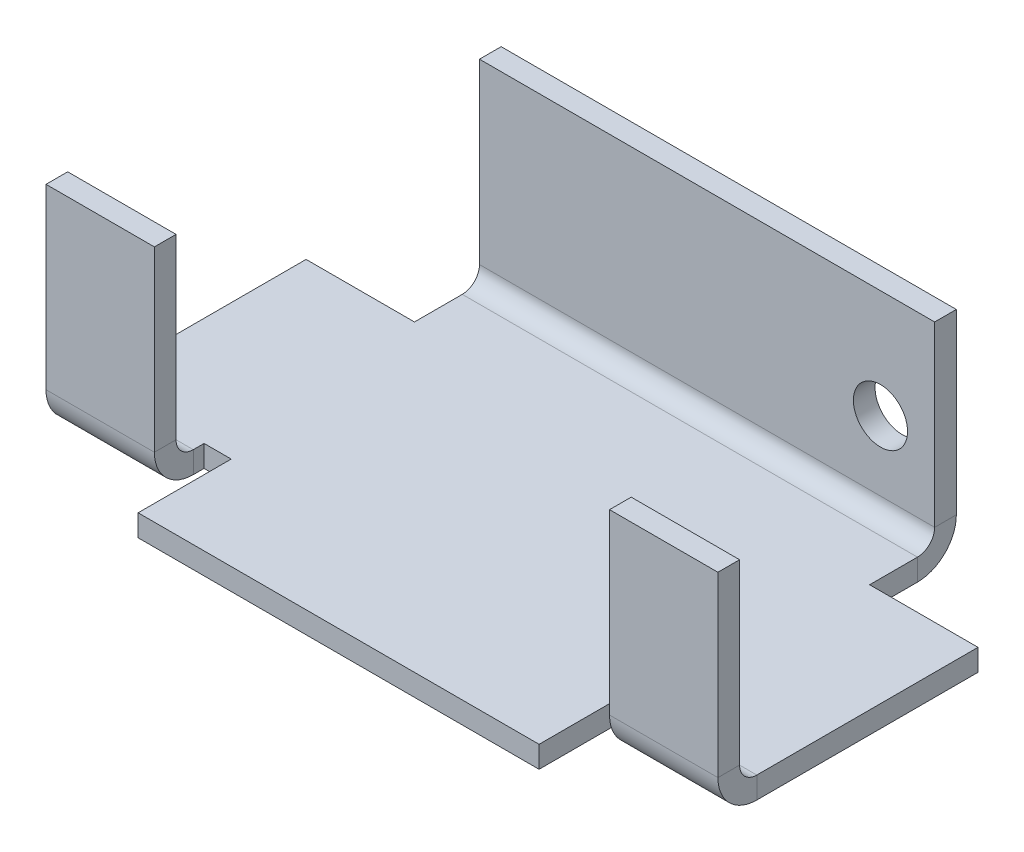
ISO-10303-21;
HEADER;
FILE_DESCRIPTION(('STEP AP214'),'2;1');
FILE_NAME('part.step','',(''),(''),'','','');
FILE_SCHEMA(('AUTOMOTIVE_DESIGN { 1 0 10303 214 1 1 1 1 }'));
ENDSEC;
DATA;
#1=APPLICATION_CONTEXT('core data for automotive mechanical design processes');
#2=APPLICATION_PROTOCOL_DEFINITION('international standard','automotive_design',2000,#1);
#3=PRODUCT_CONTEXT('',#1,'mechanical');
#4=PRODUCT('Part','Part','',(#3));
#5=PRODUCT_RELATED_PRODUCT_CATEGORY('part','',(#4));
#6=PRODUCT_DEFINITION_FORMATION('','',#4);
#7=PRODUCT_DEFINITION_CONTEXT('part definition',#1,'design');
#8=PRODUCT_DEFINITION('design','',#6,#7);
#9=PRODUCT_DEFINITION_SHAPE('','',#8);
#10=(LENGTH_UNIT() NAMED_UNIT(*) SI_UNIT(.MILLI.,.METRE.));
#11=(NAMED_UNIT(*) PLANE_ANGLE_UNIT() SI_UNIT($,.RADIAN.));
#12=(NAMED_UNIT(*) SI_UNIT($,.STERADIAN.) SOLID_ANGLE_UNIT());
#13=UNCERTAINTY_MEASURE_WITH_UNIT(LENGTH_MEASURE(1.E-05),#10,'distance_accuracy_value','');
#14=(GEOMETRIC_REPRESENTATION_CONTEXT(3) GLOBAL_UNCERTAINTY_ASSIGNED_CONTEXT((#13)) GLOBAL_UNIT_ASSIGNED_CONTEXT((#10,
#11,#12)) REPRESENTATION_CONTEXT('',''));
#15=CARTESIAN_POINT('',(0.,0.,0.));
#16=DIRECTION('',(0.,0.,1.));
#17=DIRECTION('',(1.,0.,0.));
#18=AXIS2_PLACEMENT_3D('',#15,#16,#17);
#19=CARTESIAN_POINT('',(0.,-2.,0.));
#20=DIRECTION('',(0.,-1.,0.));
#21=DIRECTION('',(0.,0.,-1.));
#22=AXIS2_PLACEMENT_3D('',#19,#20,#21);
#23=PLANE('',#22);
#24=DIRECTION('',(0.,0.,1.));
#25=VECTOR('',#24,1.);
#26=CARTESIAN_POINT('',(39.5,-2.,-8.5875));
#27=LINE('',#26,#25);
#28=CARTESIAN_POINT('',(39.5,-2.,-8.5875));
#29=VERTEX_POINT('',#28);
#30=CARTESIAN_POINT('',(39.5,-2.,0.));
#31=VERTEX_POINT('',#30);
#32=EDGE_CURVE('E291',#29,#31,#27,.T.);
#33=ORIENTED_EDGE('',*,*,#32,.T.);
#34=DIRECTION('',(1.,0.,0.));
#35=VECTOR('',#34,1.);
#36=CARTESIAN_POINT('',(0.,-2.,0.));
#37=LINE('',#36,#35);
#38=CARTESIAN_POINT('',(2.5,-2.,0.));
#39=VERTEX_POINT('',#38);
#40=EDGE_CURVE('E108',#39,#31,#37,.T.);
#41=ORIENTED_EDGE('',*,*,#40,.F.);
#42=DIRECTION('',(0.,0.,-1.));
#43=VECTOR('',#42,1.);
#44=CARTESIAN_POINT('',(2.5,-2.,-8.5875));
#45=LINE('',#44,#43);
#46=CARTESIAN_POINT('',(2.5,-2.,-8.5875));
#47=VERTEX_POINT('',#46);
#48=EDGE_CURVE('E321',#39,#47,#45,.T.);
#49=ORIENTED_EDGE('',*,*,#48,.T.);
#50=DIRECTION('',(-1.,0.,0.));
#51=VECTOR('',#50,1.);
#52=CARTESIAN_POINT('',(0.,-2.,-8.5875));
#53=LINE('',#52,#51);
#54=CARTESIAN_POINT('',(0.,-2.,-8.5875));
#55=VERTEX_POINT('',#54);
#56=EDGE_CURVE('E116',#47,#55,#53,.T.);
#57=ORIENTED_EDGE('',*,*,#56,.T.);
#58=DIRECTION('',(0.,0.,1.));
#59=VECTOR('',#58,1.);
#60=CARTESIAN_POINT('',(0.,-2.,0.));
#61=LINE('',#60,#59);
#62=CARTESIAN_POINT('',(0.,-2.00000000000001,-7.5875));
#63=VERTEX_POINT('',#62);
#64=EDGE_CURVE('E445',#55,#63,#61,.T.);
#65=ORIENTED_EDGE('',*,*,#64,.T.);
#66=DIRECTION('',(1.,0.,0.));
#67=VECTOR('',#66,1.);
#68=CARTESIAN_POINT('',(0.,-2.00000000000001,-7.5875));
#69=LINE('',#68,#67);
#70=CARTESIAN_POINT('',(-10.,-2.,-7.5875));
#71=VERTEX_POINT('',#70);
#72=EDGE_CURVE('E419',#63,#71,#69,.F.);
#73=ORIENTED_EDGE('',*,*,#72,.T.);
#74=DIRECTION('',(0.,0.,1.));
#75=VECTOR('',#74,1.);
#76=CARTESIAN_POINT('',(-10.,-2.,-28.));
#77=LINE('',#76,#75);
#78=CARTESIAN_POINT('',(-10.,-2.,-28.));
#79=VERTEX_POINT('',#78);
#80=EDGE_CURVE('E508',#79,#71,#77,.T.);
#81=ORIENTED_EDGE('',*,*,#80,.F.);
#82=DIRECTION('',(-1.,0.,0.));
#83=VECTOR('',#82,1.);
#84=CARTESIAN_POINT('',(0.,-2.,-28.));
#85=LINE('',#84,#83);
#86=CARTESIAN_POINT('',(0.,-2.,-28.));
#87=VERTEX_POINT('',#86);
#88=EDGE_CURVE('E505',#87,#79,#85,.T.);
#89=ORIENTED_EDGE('',*,*,#88,.F.);
#90=DIRECTION('',(0.,0.,1.));
#91=VECTOR('',#90,1.);
#92=CARTESIAN_POINT('',(0.,-2.,0.));
#93=LINE('',#92,#91);
#94=CARTESIAN_POINT('',(0.,-2.00000000000002,-32.4125));
#95=VERTEX_POINT('',#94);
#96=EDGE_CURVE('E536',#95,#87,#93,.T.);
#97=ORIENTED_EDGE('',*,*,#96,.F.);
#98=DIRECTION('',(-1.,0.,0.));
#99=VECTOR('',#98,1.);
#100=CARTESIAN_POINT('',(0.,-2.00000000000002,-32.4125));
#101=LINE('',#100,#99);
#102=CARTESIAN_POINT('',(42.,-2.,-32.4125));
#103=VERTEX_POINT('',#102);
#104=EDGE_CURVE('E482',#95,#103,#101,.F.);
#105=ORIENTED_EDGE('',*,*,#104,.T.);
#106=DIRECTION('',(0.,0.,-1.));
#107=VECTOR('',#106,1.);
#108=CARTESIAN_POINT('',(42.,-2.,0.));
#109=LINE('',#108,#107);
#110=CARTESIAN_POINT('',(42.,-2.,-28.));
#111=VERTEX_POINT('',#110);
#112=EDGE_CURVE('E13',#111,#103,#109,.T.);
#113=ORIENTED_EDGE('',*,*,#112,.F.);
#114=DIRECTION('',(-1.,0.,0.));
#115=VECTOR('',#114,1.);
#116=CARTESIAN_POINT('',(42.,-2.,-28.));
#117=LINE('',#116,#115);
#118=CARTESIAN_POINT('',(52.,-2.,-28.));
#119=VERTEX_POINT('',#118);
#120=EDGE_CURVE('E524',#119,#111,#117,.T.);
#121=ORIENTED_EDGE('',*,*,#120,.F.);
#122=DIRECTION('',(0.,0.,-1.));
#123=VECTOR('',#122,1.);
#124=CARTESIAN_POINT('',(52.,-2.,-28.));
#125=LINE('',#124,#123);
#126=CARTESIAN_POINT('',(52.,-2.00000000000001,-7.5875));
#127=VERTEX_POINT('',#126);
#128=EDGE_CURVE('E522',#127,#119,#125,.T.);
#129=ORIENTED_EDGE('',*,*,#128,.F.);
#130=DIRECTION('',(1.,0.,0.));
#131=VECTOR('',#130,1.);
#132=CARTESIAN_POINT('',(52.,-2.00000000000001,-7.5875));
#133=LINE('',#132,#131);
#134=CARTESIAN_POINT('',(42.,-2.,-7.5875));
#135=VERTEX_POINT('',#134);
#136=EDGE_CURVE('E361',#127,#135,#133,.F.);
#137=ORIENTED_EDGE('',*,*,#136,.T.);
#138=DIRECTION('',(0.,0.,-1.));
#139=VECTOR('',#138,1.);
#140=CARTESIAN_POINT('',(42.,-2.,0.));
#141=LINE('',#140,#139);
#142=CARTESIAN_POINT('',(42.,-2.,-8.5875));
#143=VERTEX_POINT('',#142);
#144=EDGE_CURVE('E295',#135,#143,#141,.T.);
#145=ORIENTED_EDGE('',*,*,#144,.T.);
#146=DIRECTION('',(-1.,0.,0.));
#147=VECTOR('',#146,1.);
#148=CARTESIAN_POINT('',(0.,-2.,-8.5875));
#149=LINE('',#148,#147);
#150=EDGE_CURVE('E287',#143,#29,#149,.T.);
#151=ORIENTED_EDGE('',*,*,#150,.T.);
#152=EDGE_LOOP('',(#33,#41,#49,#57,#65,#73,#81,#89,#97,#105,#113,#121,#129,#137,#145,#151));
#153=FACE_BOUND('',#152,.T.);
#154=ADVANCED_FACE('F99',(#153),#23,.T.);
#155=CARTESIAN_POINT('',(0.,0.,0.));
#156=DIRECTION('',(0.,-1.,0.));
#157=DIRECTION('',(0.,0.,-1.));
#158=AXIS2_PLACEMENT_3D('',#155,#156,#157);
#159=PLANE('',#158);
#160=DIRECTION('',(1.,0.,0.));
#161=VECTOR('',#160,1.);
#162=CARTESIAN_POINT('',(0.,0.,0.));
#163=LINE('',#162,#161);
#164=CARTESIAN_POINT('',(2.5,0.,0.));
#165=VERTEX_POINT('',#164);
#166=CARTESIAN_POINT('',(39.5,0.,0.));
#167=VERTEX_POINT('',#166);
#168=EDGE_CURVE('E539',#165,#167,#163,.T.);
#169=ORIENTED_EDGE('',*,*,#168,.T.);
#170=DIRECTION('',(0.,0.,1.));
#171=VECTOR('',#170,1.);
#172=CARTESIAN_POINT('',(39.5,0.,-8.5875));
#173=LINE('',#172,#171);
#174=CARTESIAN_POINT('',(39.5,0.,-8.5875));
#175=VERTEX_POINT('',#174);
#176=EDGE_CURVE('E311',#175,#167,#173,.T.);
#177=ORIENTED_EDGE('',*,*,#176,.F.);
#178=DIRECTION('',(-1.,0.,0.));
#179=VECTOR('',#178,1.);
#180=CARTESIAN_POINT('',(42.,0.,-8.5875));
#181=LINE('',#180,#179);
#182=CARTESIAN_POINT('',(42.,0.,-8.5875));
#183=VERTEX_POINT('',#182);
#184=EDGE_CURVE('E304',#183,#175,#181,.T.);
#185=ORIENTED_EDGE('',*,*,#184,.F.);
#186=DIRECTION('',(0.,0.,-1.));
#187=VECTOR('',#186,1.);
#188=CARTESIAN_POINT('',(42.,0.,-7.5875));
#189=LINE('',#188,#187);
#190=CARTESIAN_POINT('',(42.,0.,-7.5875));
#191=VERTEX_POINT('',#190);
#192=EDGE_CURVE('E298',#191,#183,#189,.T.);
#193=ORIENTED_EDGE('',*,*,#192,.F.);
#194=DIRECTION('',(1.,0.,0.));
#195=VECTOR('',#194,1.);
#196=CARTESIAN_POINT('',(52.,0.,-7.5875));
#197=LINE('',#196,#195);
#198=CARTESIAN_POINT('',(52.,0.,-7.5875));
#199=VERTEX_POINT('',#198);
#200=EDGE_CURVE('E373',#199,#191,#197,.F.);
#201=ORIENTED_EDGE('',*,*,#200,.F.);
#202=DIRECTION('',(0.,0.,-1.));
#203=VECTOR('',#202,1.);
#204=CARTESIAN_POINT('',(52.,0.,-28.));
#205=LINE('',#204,#203);
#206=CARTESIAN_POINT('',(52.,0.,-28.));
#207=VERTEX_POINT('',#206);
#208=EDGE_CURVE('E519',#199,#207,#205,.T.);
#209=ORIENTED_EDGE('',*,*,#208,.T.);
#210=DIRECTION('',(-1.,0.,0.));
#211=VECTOR('',#210,1.);
#212=CARTESIAN_POINT('',(42.,0.,-28.));
#213=LINE('',#212,#211);
#214=CARTESIAN_POINT('',(42.,0.,-28.));
#215=VERTEX_POINT('',#214);
#216=EDGE_CURVE('E525',#207,#215,#213,.T.);
#217=ORIENTED_EDGE('',*,*,#216,.T.);
#218=DIRECTION('',(0.,0.,-1.));
#219=VECTOR('',#218,1.);
#220=CARTESIAN_POINT('',(42.,0.,0.));
#221=LINE('',#220,#219);
#222=CARTESIAN_POINT('',(42.,0.,-32.4125));
#223=VERTEX_POINT('',#222);
#224=EDGE_CURVE('E103',#215,#223,#221,.T.);
#225=ORIENTED_EDGE('',*,*,#224,.T.);
#226=DIRECTION('',(-1.,0.,0.));
#227=VECTOR('',#226,1.);
#228=CARTESIAN_POINT('',(0.,0.,-32.4125));
#229=LINE('',#228,#227);
#230=CARTESIAN_POINT('',(0.,0.,-32.4125));
#231=VERTEX_POINT('',#230);
#232=EDGE_CURVE('E495',#231,#223,#229,.F.);
#233=ORIENTED_EDGE('',*,*,#232,.F.);
#234=DIRECTION('',(0.,0.,1.));
#235=VECTOR('',#234,1.);
#236=CARTESIAN_POINT('',(0.,0.,0.));
#237=LINE('',#236,#235);
#238=CARTESIAN_POINT('',(0.,0.,-28.));
#239=VERTEX_POINT('',#238);
#240=EDGE_CURVE('E533',#231,#239,#237,.T.);
#241=ORIENTED_EDGE('',*,*,#240,.T.);
#242=DIRECTION('',(-1.,0.,0.));
#243=VECTOR('',#242,1.);
#244=CARTESIAN_POINT('',(0.,0.,-28.));
#245=LINE('',#244,#243);
#246=CARTESIAN_POINT('',(-10.,0.,-28.));
#247=VERTEX_POINT('',#246);
#248=EDGE_CURVE('E502',#239,#247,#245,.T.);
#249=ORIENTED_EDGE('',*,*,#248,.T.);
#250=DIRECTION('',(0.,0.,1.));
#251=VECTOR('',#250,1.);
#252=CARTESIAN_POINT('',(-10.,0.,-28.));
#253=LINE('',#252,#251);
#254=CARTESIAN_POINT('',(-10.,0.,-7.5875));
#255=VERTEX_POINT('',#254);
#256=EDGE_CURVE('E509',#247,#255,#253,.T.);
#257=ORIENTED_EDGE('',*,*,#256,.T.);
#258=DIRECTION('',(1.,0.,0.));
#259=VECTOR('',#258,1.);
#260=CARTESIAN_POINT('',(0.,0.,-7.5875));
#261=LINE('',#260,#259);
#262=CARTESIAN_POINT('',(0.,0.,-7.5875));
#263=VERTEX_POINT('',#262);
#264=EDGE_CURVE('E432',#263,#255,#261,.F.);
#265=ORIENTED_EDGE('',*,*,#264,.F.);
#266=DIRECTION('',(0.,0.,1.));
#267=VECTOR('',#266,1.);
#268=CARTESIAN_POINT('',(0.,0.,-8.5875));
#269=LINE('',#268,#267);
#270=CARTESIAN_POINT('',(0.,0.,-8.5875));
#271=VERTEX_POINT('',#270);
#272=EDGE_CURVE('E124',#271,#263,#269,.T.);
#273=ORIENTED_EDGE('',*,*,#272,.F.);
#274=DIRECTION('',(-1.,0.,0.));
#275=VECTOR('',#274,1.);
#276=CARTESIAN_POINT('',(1.,0.,-8.5875));
#277=LINE('',#276,#275);
#278=CARTESIAN_POINT('',(2.5,0.,-8.5875));
#279=VERTEX_POINT('',#278);
#280=EDGE_CURVE('E442',#279,#271,#277,.T.);
#281=ORIENTED_EDGE('',*,*,#280,.F.);
#282=DIRECTION('',(0.,0.,-1.));
#283=VECTOR('',#282,1.);
#284=CARTESIAN_POINT('',(2.5,0.,-8.5875));
#285=LINE('',#284,#283);
#286=EDGE_CURVE('E319',#165,#279,#285,.T.);
#287=ORIENTED_EDGE('',*,*,#286,.F.);
#288=EDGE_LOOP('',(#169,#177,#185,#193,#201,#209,#217,#225,#233,#241,#249,#257,#265,#273,#281,#287));
#289=FACE_BOUND('',#288,.T.);
#290=ADVANCED_FACE('F547',(#289),#159,.F.);
#291=CARTESIAN_POINT('',(52.,-2.,-28.));
#292=DIRECTION('',(1.,0.,0.));
#293=DIRECTION('',(0.,0.,-1.));
#294=AXIS2_PLACEMENT_3D('',#291,#292,#293);
#295=PLANE('',#294);
#296=ORIENTED_EDGE('',*,*,#208,.F.);
#297=DIRECTION('',(0.,-1.,0.));
#298=VECTOR('',#297,1.);
#299=CARTESIAN_POINT('',(52.,0.,-7.5875));
#300=LINE('',#299,#298);
#301=EDGE_CURVE('E367',#199,#127,#300,.T.);
#302=ORIENTED_EDGE('',*,*,#301,.T.);
#303=ORIENTED_EDGE('',*,*,#128,.T.);
#304=DIRECTION('',(0.,1.,0.));
#305=VECTOR('',#304,1.);
#306=CARTESIAN_POINT('',(52.,-2.,-28.));
#307=LINE('',#306,#305);
#308=EDGE_CURVE('E527',#119,#207,#307,.T.);
#309=ORIENTED_EDGE('',*,*,#308,.T.);
#310=EDGE_LOOP('',(#296,#302,#303,#309));
#311=FACE_BOUND('',#310,.T.);
#312=ADVANCED_FACE('F607',(#311),#295,.T.);
#313=CARTESIAN_POINT('',(0.,-2.,0.));
#314=DIRECTION('',(-1.,0.,0.));
#315=DIRECTION('',(0.,0.,1.));
#316=AXIS2_PLACEMENT_3D('',#313,#314,#315);
#317=PLANE('',#316);
#318=ORIENTED_EDGE('',*,*,#240,.F.);
#319=DIRECTION('',(0.,-1.,0.));
#320=VECTOR('',#319,1.);
#321=CARTESIAN_POINT('',(0.,0.,-32.4125));
#322=LINE('',#321,#320);
#323=EDGE_CURVE('E489',#231,#95,#322,.T.);
#324=ORIENTED_EDGE('',*,*,#323,.T.);
#325=ORIENTED_EDGE('',*,*,#96,.T.);
#326=DIRECTION('',(0.,1.,0.));
#327=VECTOR('',#326,1.);
#328=CARTESIAN_POINT('',(0.,-2.,-28.));
#329=LINE('',#328,#327);
#330=EDGE_CURVE('E512',#87,#239,#329,.T.);
#331=ORIENTED_EDGE('',*,*,#330,.T.);
#332=EDGE_LOOP('',(#318,#324,#325,#331));
#333=FACE_BOUND('',#332,.T.);
#334=ADVANCED_FACE('F101',(#333),#317,.T.);
#335=CARTESIAN_POINT('',(42.,-2.,0.));
#336=DIRECTION('',(1.,0.,0.));
#337=DIRECTION('',(0.,0.,-1.));
#338=AXIS2_PLACEMENT_3D('',#335,#336,#337);
#339=PLANE('',#338);
#340=DIRECTION('',(0.,-1.,0.));
#341=VECTOR('',#340,1.);
#342=CARTESIAN_POINT('',(42.,0.,-32.4125));
#343=LINE('',#342,#341);
#344=EDGE_CURVE('E499',#223,#103,#343,.T.);
#345=ORIENTED_EDGE('',*,*,#344,.F.);
#346=ORIENTED_EDGE('',*,*,#224,.F.);
#347=DIRECTION('',(0.,1.,0.));
#348=VECTOR('',#347,1.);
#349=CARTESIAN_POINT('',(42.,-2.,-28.));
#350=LINE('',#349,#348);
#351=EDGE_CURVE('E531',#111,#215,#350,.T.);
#352=ORIENTED_EDGE('',*,*,#351,.F.);
#353=ORIENTED_EDGE('',*,*,#112,.T.);
#354=EDGE_LOOP('',(#345,#346,#352,#353));
#355=FACE_BOUND('',#354,.T.);
#356=ADVANCED_FACE('F552',(#355),#339,.T.);
#357=CARTESIAN_POINT('',(0.,-2.,0.));
#358=DIRECTION('',(0.,0.,1.));
#359=DIRECTION('',(1.,0.,0.));
#360=AXIS2_PLACEMENT_3D('',#357,#358,#359);
#361=PLANE('',#360);
#362=DIRECTION('',(0.,1.,0.));
#363=VECTOR('',#362,1.);
#364=CARTESIAN_POINT('',(39.5,-2.,0.));
#365=LINE('',#364,#363);
#366=EDGE_CURVE('E307',#31,#167,#365,.T.);
#367=ORIENTED_EDGE('',*,*,#366,.T.);
#368=ORIENTED_EDGE('',*,*,#168,.F.);
#369=DIRECTION('',(0.,1.,0.));
#370=VECTOR('',#369,1.);
#371=CARTESIAN_POINT('',(2.5,-2.,0.));
#372=LINE('',#371,#370);
#373=EDGE_CURVE('E323',#39,#165,#372,.T.);
#374=ORIENTED_EDGE('',*,*,#373,.F.);
#375=ORIENTED_EDGE('',*,*,#40,.T.);
#376=EDGE_LOOP('',(#367,#368,#374,#375));
#377=FACE_BOUND('',#376,.T.);
#378=ADVANCED_FACE('F587',(#377),#361,.T.);
#379=CARTESIAN_POINT('',(42.,-2.,-28.));
#380=DIRECTION('',(0.,0.,-1.));
#381=DIRECTION('',(-1.,0.,0.));
#382=AXIS2_PLACEMENT_3D('',#379,#380,#381);
#383=PLANE('',#382);
#384=ORIENTED_EDGE('',*,*,#216,.F.);
#385=ORIENTED_EDGE('',*,*,#308,.F.);
#386=ORIENTED_EDGE('',*,*,#120,.T.);
#387=ORIENTED_EDGE('',*,*,#351,.T.);
#388=EDGE_LOOP('',(#384,#385,#386,#387));
#389=FACE_BOUND('',#388,.T.);
#390=ADVANCED_FACE('F614',(#389),#383,.T.);
#391=CARTESIAN_POINT('',(-10.,-2.,-28.));
#392=DIRECTION('',(-1.,0.,0.));
#393=DIRECTION('',(0.,0.,1.));
#394=AXIS2_PLACEMENT_3D('',#391,#392,#393);
#395=PLANE('',#394);
#396=DIRECTION('',(0.,-1.,0.));
#397=VECTOR('',#396,1.);
#398=CARTESIAN_POINT('',(-10.,0.,-7.5875));
#399=LINE('',#398,#397);
#400=EDGE_CURVE('E436',#255,#71,#399,.T.);
#401=ORIENTED_EDGE('',*,*,#400,.F.);
#402=ORIENTED_EDGE('',*,*,#256,.F.);
#403=DIRECTION('',(0.,1.,0.));
#404=VECTOR('',#403,1.);
#405=CARTESIAN_POINT('',(-10.,-2.,-28.));
#406=LINE('',#405,#404);
#407=EDGE_CURVE('E517',#79,#247,#406,.T.);
#408=ORIENTED_EDGE('',*,*,#407,.F.);
#409=ORIENTED_EDGE('',*,*,#80,.T.);
#410=EDGE_LOOP('',(#401,#402,#408,#409));
#411=FACE_BOUND('',#410,.T.);
#412=ADVANCED_FACE('F576',(#411),#395,.T.);
#413=CARTESIAN_POINT('',(0.,-2.,-28.));
#414=DIRECTION('',(0.,0.,-1.));
#415=DIRECTION('',(-1.,0.,0.));
#416=AXIS2_PLACEMENT_3D('',#413,#414,#415);
#417=PLANE('',#416);
#418=ORIENTED_EDGE('',*,*,#248,.F.);
#419=ORIENTED_EDGE('',*,*,#330,.F.);
#420=ORIENTED_EDGE('',*,*,#88,.T.);
#421=ORIENTED_EDGE('',*,*,#407,.T.);
#422=EDGE_LOOP('',(#418,#419,#420,#421));
#423=FACE_BOUND('',#422,.T.);
#424=ADVANCED_FACE('F571',(#423),#417,.T.);
#425=CARTESIAN_POINT('',(42.,1.58749999999998,-32.4125));
#426=DIRECTION('',(1.,0.,0.));
#427=DIRECTION('',(0.,0.,-1.));
#428=AXIS2_PLACEMENT_3D('',#425,#426,#427);
#429=PLANE('',#428);
#430=DIRECTION('',(0.,0.,1.));
#431=VECTOR('',#430,1.);
#432=CARTESIAN_POINT('',(42.,1.58750000000001,-36.));
#433=LINE('',#432,#431);
#434=CARTESIAN_POINT('',(42.,1.58749999999998,-34.));
#435=VERTEX_POINT('',#434);
#436=CARTESIAN_POINT('',(42.,1.58749999999997,-36.));
#437=VERTEX_POINT('',#436);
#438=EDGE_CURVE('E451',#435,#437,#433,.F.);
#439=ORIENTED_EDGE('',*,*,#438,.F.);
#440=CARTESIAN_POINT('',(42.,1.58749999999998,-32.4125));
#441=DIRECTION('',(-1.,0.,0.));
#442=DIRECTION('',(0.,0.,1.));
#443=AXIS2_PLACEMENT_3D('',#440,#441,#442);
#444=CIRCLE('',#443,1.5875);
#445=EDGE_CURVE('E492',#223,#435,#444,.F.);
#446=ORIENTED_EDGE('',*,*,#445,.F.);
#447=ORIENTED_EDGE('',*,*,#344,.T.);
#448=CARTESIAN_POINT('',(42.,1.58749999999998,-32.4125));
#449=DIRECTION('',(-1.,0.,0.));
#450=DIRECTION('',(0.,0.,1.));
#451=AXIS2_PLACEMENT_3D('',#448,#449,#450);
#452=CIRCLE('',#451,3.5875);
#453=EDGE_CURVE('E485',#103,#437,#452,.F.);
#454=ORIENTED_EDGE('',*,*,#453,.T.);
#455=EDGE_LOOP('',(#439,#446,#447,#454));
#456=FACE_BOUND('',#455,.T.);
#457=ADVANCED_FACE('F556',(#456),#429,.T.);
#458=CARTESIAN_POINT('',(0.,1.58749999999998,-32.4125));
#459=DIRECTION('',(1.,0.,0.));
#460=DIRECTION('',(0.,0.,-1.));
#461=AXIS2_PLACEMENT_3D('',#458,#459,#460);
#462=PLANE('',#461);
#463=CARTESIAN_POINT('',(0.,1.58749999999998,-32.4125));
#464=DIRECTION('',(-1.,0.,0.));
#465=DIRECTION('',(0.,0.,1.));
#466=AXIS2_PLACEMENT_3D('',#463,#464,#465);
#467=CIRCLE('',#466,1.5875);
#468=CARTESIAN_POINT('',(0.,1.58749999999998,-34.));
#469=VERTEX_POINT('',#468);
#470=EDGE_CURVE('E455',#469,#231,#467,.T.);
#471=ORIENTED_EDGE('',*,*,#470,.F.);
#472=DIRECTION('',(0.,0.,1.));
#473=VECTOR('',#472,1.);
#474=CARTESIAN_POINT('',(0.,1.58749999999999,-34.));
#475=LINE('',#474,#473);
#476=CARTESIAN_POINT('',(0.,1.58750000000001,-36.));
#477=VERTEX_POINT('',#476);
#478=EDGE_CURVE('E475',#469,#477,#475,.F.);
#479=ORIENTED_EDGE('',*,*,#478,.T.);
#480=CARTESIAN_POINT('',(0.,1.58749999999998,-32.4125));
#481=DIRECTION('',(-1.,0.,0.));
#482=DIRECTION('',(0.,0.,1.));
#483=AXIS2_PLACEMENT_3D('',#480,#481,#482);
#484=CIRCLE('',#483,3.5875);
#485=EDGE_CURVE('E486',#477,#95,#484,.T.);
#486=ORIENTED_EDGE('',*,*,#485,.T.);
#487=ORIENTED_EDGE('',*,*,#323,.F.);
#488=EDGE_LOOP('',(#471,#479,#486,#487));
#489=FACE_BOUND('',#488,.T.);
#490=ADVANCED_FACE('F564',(#489),#462,.F.);
#491=CARTESIAN_POINT('',(0.,1.58749999999998,-32.4125));
#492=DIRECTION('',(-1.,0.,0.));
#493=DIRECTION('',(0.,0.,-1.));
#494=AXIS2_PLACEMENT_3D('',#491,#492,#493);
#495=CYLINDRICAL_SURFACE('',#494,3.5875);
#496=ORIENTED_EDGE('',*,*,#104,.F.);
#497=ORIENTED_EDGE('',*,*,#485,.F.);
#498=DIRECTION('',(-1.,0.,0.));
#499=VECTOR('',#498,1.);
#500=CARTESIAN_POINT('',(42.,1.58750000000001,-36.));
#501=LINE('',#500,#499);
#502=EDGE_CURVE('E473',#477,#437,#501,.F.);
#503=ORIENTED_EDGE('',*,*,#502,.T.);
#504=ORIENTED_EDGE('',*,*,#453,.F.);
#505=EDGE_LOOP('',(#496,#497,#503,#504));
#506=FACE_BOUND('',#505,.T.);
#507=ADVANCED_FACE('F561',(#506),#495,.T.);
#508=CARTESIAN_POINT('',(0.,1.58749999999998,-32.4125));
#509=DIRECTION('',(-1.,0.,0.));
#510=DIRECTION('',(0.,0.,-1.));
#511=AXIS2_PLACEMENT_3D('',#508,#509,#510);
#512=CYLINDRICAL_SURFACE('',#511,1.5875);
#513=ORIENTED_EDGE('',*,*,#232,.T.);
#514=ORIENTED_EDGE('',*,*,#445,.T.);
#515=DIRECTION('',(-1.,0.,0.));
#516=VECTOR('',#515,1.);
#517=CARTESIAN_POINT('',(42.,1.58749999999999,-34.));
#518=LINE('',#517,#516);
#519=EDGE_CURVE('E478',#435,#469,#518,.T.);
#520=ORIENTED_EDGE('',*,*,#519,.T.);
#521=ORIENTED_EDGE('',*,*,#470,.T.);
#522=EDGE_LOOP('',(#513,#514,#520,#521));
#523=FACE_BOUND('',#522,.T.);
#524=ADVANCED_FACE('F630',(#523),#512,.F.);
#525=CARTESIAN_POINT('',(42.,0.,-36.));
#526=DIRECTION('',(-1.,0.,0.));
#527=DIRECTION('',(0.,0.,1.));
#528=AXIS2_PLACEMENT_3D('',#525,#526,#527);
#529=PLANE('',#528);
#530=ORIENTED_EDGE('',*,*,#438,.T.);
#531=DIRECTION('',(0.,-1.,0.));
#532=VECTOR('',#531,1.);
#533=CARTESIAN_POINT('',(42.,-1.31883052948016E-13,-36.));
#534=LINE('',#533,#532);
#535=CARTESIAN_POINT('',(42.,18.,-36.0000000000001));
#536=VERTEX_POINT('',#535);
#537=EDGE_CURVE('E463',#536,#437,#534,.T.);
#538=ORIENTED_EDGE('',*,*,#537,.F.);
#539=DIRECTION('',(0.,0.,1.));
#540=VECTOR('',#539,1.);
#541=CARTESIAN_POINT('',(42.,18.,-36.0000000000001));
#542=LINE('',#541,#540);
#543=CARTESIAN_POINT('',(42.,18.,-34.0000000000001));
#544=VERTEX_POINT('',#543);
#545=EDGE_CURVE('E456',#536,#544,#542,.T.);
#546=ORIENTED_EDGE('',*,*,#545,.T.);
#547=DIRECTION('',(0.,1.,0.));
#548=VECTOR('',#547,1.);
#549=CARTESIAN_POINT('',(42.,0.,-34.));
#550=LINE('',#549,#548);
#551=EDGE_CURVE('E470',#544,#435,#550,.F.);
#552=ORIENTED_EDGE('',*,*,#551,.T.);
#553=EDGE_LOOP('',(#530,#538,#546,#552));
#554=FACE_BOUND('',#553,.T.);
#555=ADVANCED_FACE('F633',(#554),#529,.F.);
#556=CARTESIAN_POINT('',(0.,18.,-36.0000000000001));
#557=DIRECTION('',(1.,0.,0.));
#558=DIRECTION('',(0.,0.,-1.));
#559=AXIS2_PLACEMENT_3D('',#556,#557,#558);
#560=PLANE('',#559);
#561=ORIENTED_EDGE('',*,*,#478,.F.);
#562=DIRECTION('',(0.,-1.,0.));
#563=VECTOR('',#562,1.);
#564=CARTESIAN_POINT('',(0.,18.,-34.0000000000001));
#565=LINE('',#564,#563);
#566=CARTESIAN_POINT('',(0.,18.,-34.0000000000001));
#567=VERTEX_POINT('',#566);
#568=EDGE_CURVE('E468',#469,#567,#565,.F.);
#569=ORIENTED_EDGE('',*,*,#568,.T.);
#570=DIRECTION('',(0.,0.,1.));
#571=VECTOR('',#570,1.);
#572=CARTESIAN_POINT('',(0.,18.,-36.0000000000001));
#573=LINE('',#572,#571);
#574=CARTESIAN_POINT('',(0.,18.,-36.0000000000001));
#575=VERTEX_POINT('',#574);
#576=EDGE_CURVE('E452',#575,#567,#573,.T.);
#577=ORIENTED_EDGE('',*,*,#576,.F.);
#578=DIRECTION('',(0.,1.,0.));
#579=VECTOR('',#578,1.);
#580=CARTESIAN_POINT('',(0.,-1.31883052948016E-13,-36.));
#581=LINE('',#580,#579);
#582=EDGE_CURVE('E461',#477,#575,#581,.T.);
#583=ORIENTED_EDGE('',*,*,#582,.F.);
#584=EDGE_LOOP('',(#561,#569,#577,#583));
#585=FACE_BOUND('',#584,.T.);
#586=ADVANCED_FACE('F639',(#585),#560,.F.);
#587=CARTESIAN_POINT('',(0.,-1.31883052948016E-13,-36.));
#588=DIRECTION('',(0.,0.,1.));
#589=DIRECTION('',(0.,-1.,0.));
#590=AXIS2_PLACEMENT_3D('',#587,#588,#589);
#591=PLANE('',#590);
#592=CARTESIAN_POINT('',(37.,8.,-36.));
#593=DIRECTION('',(0.,0.,-1.));
#594=DIRECTION('',(0.,1.,0.));
#595=AXIS2_PLACEMENT_3D('',#592,#593,#594);
#596=CIRCLE('',#595,2.5);
#597=CARTESIAN_POINT('',(37.,10.5,-36.));
#598=VERTEX_POINT('',#597);
#599=EDGE_CURVE('E313',#598,#598,#596,.T.);
#600=ORIENTED_EDGE('',*,*,#599,.F.);
#601=EDGE_LOOP('',(#600));
#602=FACE_BOUND('',#601,.T.);
#603=ORIENTED_EDGE('',*,*,#502,.F.);
#604=ORIENTED_EDGE('',*,*,#582,.T.);
#605=DIRECTION('',(1.,0.,0.));
#606=VECTOR('',#605,1.);
#607=CARTESIAN_POINT('',(0.,18.,-36.0000000000001));
#608=LINE('',#607,#606);
#609=EDGE_CURVE('E459',#575,#536,#608,.T.);
#610=ORIENTED_EDGE('',*,*,#609,.T.);
#611=ORIENTED_EDGE('',*,*,#537,.T.);
#612=EDGE_LOOP('',(#603,#604,#610,#611));
#613=FACE_BOUND('',#612,.T.);
#614=ADVANCED_FACE('F643',(#602,#613),#591,.F.);
#615=CARTESIAN_POINT('',(0.,-1.2490009027033E-13,-34.));
#616=DIRECTION('',(0.,0.,1.));
#617=DIRECTION('',(0.,-1.,0.));
#618=AXIS2_PLACEMENT_3D('',#615,#616,#617);
#619=PLANE('',#618);
#620=CARTESIAN_POINT('',(37.,8.00000000000001,-34.));
#621=DIRECTION('',(0.,0.,1.));
#622=DIRECTION('',(0.,-1.,0.));
#623=AXIS2_PLACEMENT_3D('',#620,#621,#622);
#624=CIRCLE('',#623,2.5);
#625=CARTESIAN_POINT('',(37.,5.50000000000001,-34.));
#626=VERTEX_POINT('',#625);
#627=EDGE_CURVE('E316',#626,#626,#624,.F.);
#628=ORIENTED_EDGE('',*,*,#627,.T.);
#629=EDGE_LOOP('',(#628));
#630=FACE_BOUND('',#629,.T.);
#631=ORIENTED_EDGE('',*,*,#568,.F.);
#632=ORIENTED_EDGE('',*,*,#519,.F.);
#633=ORIENTED_EDGE('',*,*,#551,.F.);
#634=DIRECTION('',(-1.,0.,0.));
#635=VECTOR('',#634,1.);
#636=CARTESIAN_POINT('',(42.,18.,-34.0000000000001));
#637=LINE('',#636,#635);
#638=EDGE_CURVE('E466',#567,#544,#637,.F.);
#639=ORIENTED_EDGE('',*,*,#638,.F.);
#640=EDGE_LOOP('',(#631,#632,#633,#639));
#641=FACE_BOUND('',#640,.T.);
#642=ADVANCED_FACE('F648',(#630,#641),#619,.T.);
#643=CARTESIAN_POINT('',(42.,18.,-36.0000000000001));
#644=DIRECTION('',(0.,-1.,0.));
#645=DIRECTION('',(0.,0.,-1.));
#646=AXIS2_PLACEMENT_3D('',#643,#644,#645);
#647=PLANE('',#646);
#648=ORIENTED_EDGE('',*,*,#638,.T.);
#649=ORIENTED_EDGE('',*,*,#545,.F.);
#650=ORIENTED_EDGE('',*,*,#609,.F.);
#651=ORIENTED_EDGE('',*,*,#576,.T.);
#652=EDGE_LOOP('',(#648,#649,#650,#651));
#653=FACE_BOUND('',#652,.T.);
#654=ADVANCED_FACE('F645',(#653),#647,.F.);
#655=CARTESIAN_POINT('',(1.,0.,-8.5875));
#656=DIRECTION('',(0.,0.,1.));
#657=DIRECTION('',(0.,-1.,0.));
#658=AXIS2_PLACEMENT_3D('',#655,#656,#657);
#659=PLANE('',#658);
#660=ORIENTED_EDGE('',*,*,#56,.F.);
#661=DIRECTION('',(0.,1.,0.));
#662=VECTOR('',#661,1.);
#663=CARTESIAN_POINT('',(2.5,-2.,-8.5875));
#664=LINE('',#663,#662);
#665=EDGE_CURVE('E326',#47,#279,#664,.T.);
#666=ORIENTED_EDGE('',*,*,#665,.T.);
#667=ORIENTED_EDGE('',*,*,#280,.T.);
#668=DIRECTION('',(0.,-1.,0.));
#669=VECTOR('',#668,1.);
#670=CARTESIAN_POINT('',(0.,0.,-8.5875));
#671=LINE('',#670,#669);
#672=EDGE_CURVE('E439',#271,#55,#671,.T.);
#673=ORIENTED_EDGE('',*,*,#672,.T.);
#674=EDGE_LOOP('',(#660,#666,#667,#673));
#675=FACE_BOUND('',#674,.T.);
#676=ADVANCED_FACE('F582',(#675),#659,.T.);
#677=CARTESIAN_POINT('',(0.,0.,-8.5875));
#678=DIRECTION('',(1.,0.,0.));
#679=DIRECTION('',(0.,0.,-1.));
#680=AXIS2_PLACEMENT_3D('',#677,#678,#679);
#681=PLANE('',#680);
#682=ORIENTED_EDGE('',*,*,#64,.F.);
#683=ORIENTED_EDGE('',*,*,#672,.F.);
#684=ORIENTED_EDGE('',*,*,#272,.T.);
#685=DIRECTION('',(0.,-1.,0.));
#686=VECTOR('',#685,1.);
#687=CARTESIAN_POINT('',(0.,0.,-7.5875));
#688=LINE('',#687,#686);
#689=EDGE_CURVE('E426',#263,#63,#688,.T.);
#690=ORIENTED_EDGE('',*,*,#689,.T.);
#691=EDGE_LOOP('',(#682,#683,#684,#690));
#692=FACE_BOUND('',#691,.T.);
#693=ADVANCED_FACE('F580',(#692),#681,.T.);
#694=CARTESIAN_POINT('',(-10.,1.58749999999999,-7.5875));
#695=DIRECTION('',(-1.,0.,0.));
#696=DIRECTION('',(0.,0.,1.));
#697=AXIS2_PLACEMENT_3D('',#694,#695,#696);
#698=PLANE('',#697);
#699=DIRECTION('',(0.,0.,-1.));
#700=VECTOR('',#699,1.);
#701=CARTESIAN_POINT('',(-10.,1.58749999999999,-4.));
#702=LINE('',#701,#700);
#703=CARTESIAN_POINT('',(-10.,1.58749999999999,-6.));
#704=VERTEX_POINT('',#703);
#705=CARTESIAN_POINT('',(-10.,1.58749999999999,-4.));
#706=VERTEX_POINT('',#705);
#707=EDGE_CURVE('E388',#704,#706,#702,.F.);
#708=ORIENTED_EDGE('',*,*,#707,.F.);
#709=CARTESIAN_POINT('',(-10.,1.58749999999999,-7.5875));
#710=DIRECTION('',(1.,0.,0.));
#711=DIRECTION('',(0.,0.,-1.));
#712=AXIS2_PLACEMENT_3D('',#709,#710,#711);
#713=CIRCLE('',#712,1.5875);
#714=EDGE_CURVE('E429',#255,#704,#713,.F.);
#715=ORIENTED_EDGE('',*,*,#714,.F.);
#716=ORIENTED_EDGE('',*,*,#400,.T.);
#717=CARTESIAN_POINT('',(-10.,1.58749999999999,-7.5875));
#718=DIRECTION('',(1.,0.,0.));
#719=DIRECTION('',(0.,0.,-1.));
#720=AXIS2_PLACEMENT_3D('',#717,#718,#719);
#721=CIRCLE('',#720,3.5875);
#722=EDGE_CURVE('E422',#71,#706,#721,.F.);
#723=ORIENTED_EDGE('',*,*,#722,.T.);
#724=EDGE_LOOP('',(#708,#715,#716,#723));
#725=FACE_BOUND('',#724,.T.);
#726=ADVANCED_FACE('F660',(#725),#698,.T.);
#727=CARTESIAN_POINT('',(0.,1.58749999999999,-7.5875));
#728=DIRECTION('',(-1.,0.,0.));
#729=DIRECTION('',(0.,0.,1.));
#730=AXIS2_PLACEMENT_3D('',#727,#728,#729);
#731=PLANE('',#730);
#732=CARTESIAN_POINT('',(0.,1.58749999999999,-7.5875));
#733=DIRECTION('',(1.,0.,0.));
#734=DIRECTION('',(0.,0.,-1.));
#735=AXIS2_PLACEMENT_3D('',#732,#733,#734);
#736=CIRCLE('',#735,1.5875);
#737=CARTESIAN_POINT('',(0.,1.58749999999999,-6.));
#738=VERTEX_POINT('',#737);
#739=EDGE_CURVE('E392',#738,#263,#736,.T.);
#740=ORIENTED_EDGE('',*,*,#739,.F.);
#741=DIRECTION('',(0.,0.,-1.));
#742=VECTOR('',#741,1.);
#743=CARTESIAN_POINT('',(0.,1.58749999999999,-5.99999999999999));
#744=LINE('',#743,#742);
#745=CARTESIAN_POINT('',(0.,1.58749999999999,-4.));
#746=VERTEX_POINT('',#745);
#747=EDGE_CURVE('E412',#738,#746,#744,.F.);
#748=ORIENTED_EDGE('',*,*,#747,.T.);
#749=CARTESIAN_POINT('',(0.,1.58749999999999,-7.5875));
#750=DIRECTION('',(1.,0.,0.));
#751=DIRECTION('',(0.,0.,-1.));
#752=AXIS2_PLACEMENT_3D('',#749,#750,#751);
#753=CIRCLE('',#752,3.5875);
#754=EDGE_CURVE('E423',#746,#63,#753,.T.);
#755=ORIENTED_EDGE('',*,*,#754,.T.);
#756=ORIENTED_EDGE('',*,*,#689,.F.);
#757=EDGE_LOOP('',(#740,#748,#755,#756));
#758=FACE_BOUND('',#757,.T.);
#759=ADVANCED_FACE('F661',(#758),#731,.F.);
#760=CARTESIAN_POINT('',(0.,1.58749999999999,-7.5875));
#761=DIRECTION('',(1.,0.,0.));
#762=DIRECTION('',(0.,0.,1.));
#763=AXIS2_PLACEMENT_3D('',#760,#761,#762);
#764=CYLINDRICAL_SURFACE('',#763,3.5875);
#765=ORIENTED_EDGE('',*,*,#72,.F.);
#766=ORIENTED_EDGE('',*,*,#754,.F.);
#767=DIRECTION('',(1.,0.,0.));
#768=VECTOR('',#767,1.);
#769=CARTESIAN_POINT('',(-10.,1.58749999999999,-4.));
#770=LINE('',#769,#768);
#771=EDGE_CURVE('E410',#746,#706,#770,.F.);
#772=ORIENTED_EDGE('',*,*,#771,.T.);
#773=ORIENTED_EDGE('',*,*,#722,.F.);
#774=EDGE_LOOP('',(#765,#766,#772,#773));
#775=FACE_BOUND('',#774,.T.);
#776=ADVANCED_FACE('F664',(#775),#764,.T.);
#777=CARTESIAN_POINT('',(0.,1.58749999999999,-7.5875));
#778=DIRECTION('',(1.,0.,0.));
#779=DIRECTION('',(0.,0.,1.));
#780=AXIS2_PLACEMENT_3D('',#777,#778,#779);
#781=CYLINDRICAL_SURFACE('',#780,1.5875);
#782=ORIENTED_EDGE('',*,*,#264,.T.);
#783=ORIENTED_EDGE('',*,*,#714,.T.);
#784=DIRECTION('',(1.,0.,0.));
#785=VECTOR('',#784,1.);
#786=CARTESIAN_POINT('',(-10.,1.58749999999999,-6.));
#787=LINE('',#786,#785);
#788=EDGE_CURVE('E415',#704,#738,#787,.T.);
#789=ORIENTED_EDGE('',*,*,#788,.T.);
#790=ORIENTED_EDGE('',*,*,#739,.T.);
#791=EDGE_LOOP('',(#782,#783,#789,#790));
#792=FACE_BOUND('',#791,.T.);
#793=ADVANCED_FACE('F669',(#792),#781,.F.);
#794=CARTESIAN_POINT('',(-10.,0.,-4.));
#795=DIRECTION('',(1.,0.,0.));
#796=DIRECTION('',(0.,0.,-1.));
#797=AXIS2_PLACEMENT_3D('',#794,#795,#796);
#798=PLANE('',#797);
#799=ORIENTED_EDGE('',*,*,#707,.T.);
#800=DIRECTION('',(0.,-1.,0.));
#801=VECTOR('',#800,1.);
#802=CARTESIAN_POINT('',(-10.,0.,-4.));
#803=LINE('',#802,#801);
#804=CARTESIAN_POINT('',(-10.,18.,-4.));
#805=VERTEX_POINT('',#804);
#806=EDGE_CURVE('E400',#805,#706,#803,.T.);
#807=ORIENTED_EDGE('',*,*,#806,.F.);
#808=DIRECTION('',(0.,0.,-1.));
#809=VECTOR('',#808,1.);
#810=CARTESIAN_POINT('',(-10.,18.,-4.));
#811=LINE('',#810,#809);
#812=CARTESIAN_POINT('',(-10.,18.,-6.));
#813=VERTEX_POINT('',#812);
#814=EDGE_CURVE('E393',#805,#813,#811,.T.);
#815=ORIENTED_EDGE('',*,*,#814,.T.);
#816=DIRECTION('',(0.,1.,0.));
#817=VECTOR('',#816,1.);
#818=CARTESIAN_POINT('',(-10.,0.,-6.));
#819=LINE('',#818,#817);
#820=EDGE_CURVE('E407',#813,#704,#819,.F.);
#821=ORIENTED_EDGE('',*,*,#820,.T.);
#822=EDGE_LOOP('',(#799,#807,#815,#821));
#823=FACE_BOUND('',#822,.T.);
#824=ADVANCED_FACE('F672',(#823),#798,.F.);
#825=CARTESIAN_POINT('',(0.,18.,-4.));
#826=DIRECTION('',(-1.,0.,0.));
#827=DIRECTION('',(0.,-1.,0.));
#828=AXIS2_PLACEMENT_3D('',#825,#826,#827);
#829=PLANE('',#828);
#830=ORIENTED_EDGE('',*,*,#747,.F.);
#831=DIRECTION('',(0.,-1.,0.));
#832=VECTOR('',#831,1.);
#833=CARTESIAN_POINT('',(0.,18.,-6.));
#834=LINE('',#833,#832);
#835=CARTESIAN_POINT('',(0.,18.,-6.));
#836=VERTEX_POINT('',#835);
#837=EDGE_CURVE('E405',#738,#836,#834,.F.);
#838=ORIENTED_EDGE('',*,*,#837,.T.);
#839=DIRECTION('',(0.,0.,-1.));
#840=VECTOR('',#839,1.);
#841=CARTESIAN_POINT('',(0.,18.,-4.));
#842=LINE('',#841,#840);
#843=CARTESIAN_POINT('',(0.,18.,-4.));
#844=VERTEX_POINT('',#843);
#845=EDGE_CURVE('E389',#844,#836,#842,.T.);
#846=ORIENTED_EDGE('',*,*,#845,.F.);
#847=DIRECTION('',(0.,1.,0.));
#848=VECTOR('',#847,1.);
#849=CARTESIAN_POINT('',(0.,0.,-4.));
#850=LINE('',#849,#848);
#851=EDGE_CURVE('E398',#746,#844,#850,.T.);
#852=ORIENTED_EDGE('',*,*,#851,.F.);
#853=EDGE_LOOP('',(#830,#838,#846,#852));
#854=FACE_BOUND('',#853,.T.);
#855=ADVANCED_FACE('F678',(#854),#829,.F.);
#856=CARTESIAN_POINT('',(0.,0.,-4.));
#857=DIRECTION('',(0.,0.,-1.));
#858=DIRECTION('',(-1.,0.,0.));
#859=AXIS2_PLACEMENT_3D('',#856,#857,#858);
#860=PLANE('',#859);
#861=ORIENTED_EDGE('',*,*,#771,.F.);
#862=ORIENTED_EDGE('',*,*,#851,.T.);
#863=DIRECTION('',(-1.,0.,0.));
#864=VECTOR('',#863,1.);
#865=CARTESIAN_POINT('',(0.,18.,-4.));
#866=LINE('',#865,#864);
#867=EDGE_CURVE('E396',#844,#805,#866,.T.);
#868=ORIENTED_EDGE('',*,*,#867,.T.);
#869=ORIENTED_EDGE('',*,*,#806,.T.);
#870=EDGE_LOOP('',(#861,#862,#868,#869));
#871=FACE_BOUND('',#870,.T.);
#872=ADVANCED_FACE('F682',(#871),#860,.F.);
#873=CARTESIAN_POINT('',(0.,0.,-6.));
#874=DIRECTION('',(0.,0.,-1.));
#875=DIRECTION('',(-1.,0.,0.));
#876=AXIS2_PLACEMENT_3D('',#873,#874,#875);
#877=PLANE('',#876);
#878=ORIENTED_EDGE('',*,*,#837,.F.);
#879=ORIENTED_EDGE('',*,*,#788,.F.);
#880=ORIENTED_EDGE('',*,*,#820,.F.);
#881=DIRECTION('',(1.,0.,0.));
#882=VECTOR('',#881,1.);
#883=CARTESIAN_POINT('',(-10.,18.,-6.));
#884=LINE('',#883,#882);
#885=EDGE_CURVE('E403',#836,#813,#884,.F.);
#886=ORIENTED_EDGE('',*,*,#885,.F.);
#887=EDGE_LOOP('',(#878,#879,#880,#886));
#888=FACE_BOUND('',#887,.T.);
#889=ADVANCED_FACE('F688',(#888),#877,.T.);
#890=CARTESIAN_POINT('',(-10.,18.,-4.));
#891=DIRECTION('',(0.,-1.,0.));
#892=DIRECTION('',(0.,0.,-1.));
#893=AXIS2_PLACEMENT_3D('',#890,#891,#892);
#894=PLANE('',#893);
#895=ORIENTED_EDGE('',*,*,#885,.T.);
#896=ORIENTED_EDGE('',*,*,#814,.F.);
#897=ORIENTED_EDGE('',*,*,#867,.F.);
#898=ORIENTED_EDGE('',*,*,#845,.T.);
#899=EDGE_LOOP('',(#895,#896,#897,#898));
#900=FACE_BOUND('',#899,.T.);
#901=ADVANCED_FACE('F684',(#900),#894,.F.);
#902=CARTESIAN_POINT('',(42.,0.,-7.5875));
#903=DIRECTION('',(-1.,0.,0.));
#904=DIRECTION('',(0.,0.,1.));
#905=AXIS2_PLACEMENT_3D('',#902,#903,#904);
#906=PLANE('',#905);
#907=ORIENTED_EDGE('',*,*,#144,.F.);
#908=DIRECTION('',(0.,-1.,0.));
#909=VECTOR('',#908,1.);
#910=CARTESIAN_POINT('',(42.,0.,-7.5875));
#911=LINE('',#910,#909);
#912=EDGE_CURVE('E377',#191,#135,#911,.T.);
#913=ORIENTED_EDGE('',*,*,#912,.F.);
#914=ORIENTED_EDGE('',*,*,#192,.T.);
#915=DIRECTION('',(0.,-1.,0.));
#916=VECTOR('',#915,1.);
#917=CARTESIAN_POINT('',(42.,0.,-8.5875));
#918=LINE('',#917,#916);
#919=EDGE_CURVE('E380',#183,#143,#918,.T.);
#920=ORIENTED_EDGE('',*,*,#919,.T.);
#921=EDGE_LOOP('',(#907,#913,#914,#920));
#922=FACE_BOUND('',#921,.T.);
#923=ADVANCED_FACE('F687',(#922),#906,.T.);
#924=CARTESIAN_POINT('',(42.,0.,-8.5875));
#925=DIRECTION('',(0.,0.,1.));
#926=DIRECTION('',(0.,-1.,0.));
#927=AXIS2_PLACEMENT_3D('',#924,#925,#926);
#928=PLANE('',#927);
#929=ORIENTED_EDGE('',*,*,#150,.F.);
#930=ORIENTED_EDGE('',*,*,#919,.F.);
#931=ORIENTED_EDGE('',*,*,#184,.T.);
#932=DIRECTION('',(0.,1.,0.));
#933=VECTOR('',#932,1.);
#934=CARTESIAN_POINT('',(39.5,-2.,-8.5875));
#935=LINE('',#934,#933);
#936=EDGE_CURVE('E301',#29,#175,#935,.T.);
#937=ORIENTED_EDGE('',*,*,#936,.F.);
#938=EDGE_LOOP('',(#929,#930,#931,#937));
#939=FACE_BOUND('',#938,.T.);
#940=ADVANCED_FACE('F302',(#939),#928,.T.);
#941=CARTESIAN_POINT('',(42.,1.58749999999999,-7.5875));
#942=DIRECTION('',(-1.,0.,0.));
#943=DIRECTION('',(0.,0.,1.));
#944=AXIS2_PLACEMENT_3D('',#941,#942,#943);
#945=PLANE('',#944);
#946=DIRECTION('',(0.,0.,-1.));
#947=VECTOR('',#946,1.);
#948=CARTESIAN_POINT('',(42.,1.58749999999999,-4.));
#949=LINE('',#948,#947);
#950=CARTESIAN_POINT('',(42.,1.58749999999999,-6.));
#951=VERTEX_POINT('',#950);
#952=CARTESIAN_POINT('',(42.,1.58749999999999,-4.));
#953=VERTEX_POINT('',#952);
#954=EDGE_CURVE('E329',#951,#953,#949,.F.);
#955=ORIENTED_EDGE('',*,*,#954,.F.);
#956=CARTESIAN_POINT('',(42.,1.58749999999999,-7.5875));
#957=DIRECTION('',(1.,0.,0.));
#958=DIRECTION('',(0.,0.,-1.));
#959=AXIS2_PLACEMENT_3D('',#956,#957,#958);
#960=CIRCLE('',#959,1.5875);
#961=EDGE_CURVE('E370',#191,#951,#960,.F.);
#962=ORIENTED_EDGE('',*,*,#961,.F.);
#963=ORIENTED_EDGE('',*,*,#912,.T.);
#964=CARTESIAN_POINT('',(42.,1.58749999999999,-7.5875));
#965=DIRECTION('',(1.,0.,0.));
#966=DIRECTION('',(0.,0.,-1.));
#967=AXIS2_PLACEMENT_3D('',#964,#965,#966);
#968=CIRCLE('',#967,3.5875);
#969=EDGE_CURVE('E363',#135,#953,#968,.F.);
#970=ORIENTED_EDGE('',*,*,#969,.T.);
#971=EDGE_LOOP('',(#955,#962,#963,#970));
#972=FACE_BOUND('',#971,.T.);
#973=ADVANCED_FACE('F701',(#972),#945,.T.);
#974=CARTESIAN_POINT('',(52.,1.58749999999999,-7.5875));
#975=DIRECTION('',(-1.,0.,0.));
#976=DIRECTION('',(0.,0.,1.));
#977=AXIS2_PLACEMENT_3D('',#974,#975,#976);
#978=PLANE('',#977);
#979=CARTESIAN_POINT('',(52.,1.58749999999999,-7.5875));
#980=DIRECTION('',(1.,0.,0.));
#981=DIRECTION('',(0.,0.,-1.));
#982=AXIS2_PLACEMENT_3D('',#979,#980,#981);
#983=CIRCLE('',#982,1.5875);
#984=CARTESIAN_POINT('',(52.,1.58749999999999,-6.));
#985=VERTEX_POINT('',#984);
#986=EDGE_CURVE('E334',#985,#199,#983,.T.);
#987=ORIENTED_EDGE('',*,*,#986,.F.);
#988=DIRECTION('',(0.,0.,-1.));
#989=VECTOR('',#988,1.);
#990=CARTESIAN_POINT('',(52.,1.58749999999999,-5.99999999999999));
#991=LINE('',#990,#989);
#992=CARTESIAN_POINT('',(52.,1.58749999999999,-4.));
#993=VERTEX_POINT('',#992);
#994=EDGE_CURVE('E354',#985,#993,#991,.F.);
#995=ORIENTED_EDGE('',*,*,#994,.T.);
#996=CARTESIAN_POINT('',(52.,1.58749999999999,-7.5875));
#997=DIRECTION('',(1.,0.,0.));
#998=DIRECTION('',(0.,0.,-1.));
#999=AXIS2_PLACEMENT_3D('',#996,#997,#998);
#1000=CIRCLE('',#999,3.5875);
#1001=EDGE_CURVE('E364',#993,#127,#1000,.T.);
#1002=ORIENTED_EDGE('',*,*,#1001,.T.);
#1003=ORIENTED_EDGE('',*,*,#301,.F.);
#1004=EDGE_LOOP('',(#987,#995,#1002,#1003));
#1005=FACE_BOUND('',#1004,.T.);
#1006=ADVANCED_FACE('F702',(#1005),#978,.F.);
#1007=CARTESIAN_POINT('',(52.,1.58749999999999,-7.5875));
#1008=DIRECTION('',(1.,0.,0.));
#1009=DIRECTION('',(0.,0.,1.));
#1010=AXIS2_PLACEMENT_3D('',#1007,#1008,#1009);
#1011=CYLINDRICAL_SURFACE('',#1010,3.5875);
#1012=ORIENTED_EDGE('',*,*,#136,.F.);
#1013=ORIENTED_EDGE('',*,*,#1001,.F.);
#1014=DIRECTION('',(1.,0.,0.));
#1015=VECTOR('',#1014,1.);
#1016=CARTESIAN_POINT('',(42.,1.58749999999999,-4.));
#1017=LINE('',#1016,#1015);
#1018=EDGE_CURVE('E352',#993,#953,#1017,.F.);
#1019=ORIENTED_EDGE('',*,*,#1018,.T.);
#1020=ORIENTED_EDGE('',*,*,#969,.F.);
#1021=EDGE_LOOP('',(#1012,#1013,#1019,#1020));
#1022=FACE_BOUND('',#1021,.T.);
#1023=ADVANCED_FACE('F705',(#1022),#1011,.T.);
#1024=CARTESIAN_POINT('',(52.,1.58749999999999,-7.5875));
#1025=DIRECTION('',(1.,0.,0.));
#1026=DIRECTION('',(0.,0.,1.));
#1027=AXIS2_PLACEMENT_3D('',#1024,#1025,#1026);
#1028=CYLINDRICAL_SURFACE('',#1027,1.5875);
#1029=ORIENTED_EDGE('',*,*,#200,.T.);
#1030=ORIENTED_EDGE('',*,*,#961,.T.);
#1031=DIRECTION('',(1.,0.,0.));
#1032=VECTOR('',#1031,1.);
#1033=CARTESIAN_POINT('',(42.,1.58749999999999,-6.));
#1034=LINE('',#1033,#1032);
#1035=EDGE_CURVE('E357',#951,#985,#1034,.T.);
#1036=ORIENTED_EDGE('',*,*,#1035,.T.);
#1037=ORIENTED_EDGE('',*,*,#986,.T.);
#1038=EDGE_LOOP('',(#1029,#1030,#1036,#1037));
#1039=FACE_BOUND('',#1038,.T.);
#1040=ADVANCED_FACE('F710',(#1039),#1028,.F.);
#1041=CARTESIAN_POINT('',(42.,0.,-4.));
#1042=DIRECTION('',(1.,0.,0.));
#1043=DIRECTION('',(0.,0.,-1.));
#1044=AXIS2_PLACEMENT_3D('',#1041,#1042,#1043);
#1045=PLANE('',#1044);
#1046=ORIENTED_EDGE('',*,*,#954,.T.);
#1047=DIRECTION('',(0.,-1.,0.));
#1048=VECTOR('',#1047,1.);
#1049=CARTESIAN_POINT('',(42.,0.,-4.));
#1050=LINE('',#1049,#1048);
#1051=CARTESIAN_POINT('',(42.,18.,-4.));
#1052=VERTEX_POINT('',#1051);
#1053=EDGE_CURVE('E342',#1052,#953,#1050,.T.);
#1054=ORIENTED_EDGE('',*,*,#1053,.F.);
#1055=DIRECTION('',(0.,0.,-1.));
#1056=VECTOR('',#1055,1.);
#1057=CARTESIAN_POINT('',(42.,18.,-4.));
#1058=LINE('',#1057,#1056);
#1059=CARTESIAN_POINT('',(42.,18.,-6.));
#1060=VERTEX_POINT('',#1059);
#1061=EDGE_CURVE('E335',#1052,#1060,#1058,.T.);
#1062=ORIENTED_EDGE('',*,*,#1061,.T.);
#1063=DIRECTION('',(0.,1.,0.));
#1064=VECTOR('',#1063,1.);
#1065=CARTESIAN_POINT('',(42.,0.,-6.));
#1066=LINE('',#1065,#1064);
#1067=EDGE_CURVE('E349',#1060,#951,#1066,.F.);
#1068=ORIENTED_EDGE('',*,*,#1067,.T.);
#1069=EDGE_LOOP('',(#1046,#1054,#1062,#1068));
#1070=FACE_BOUND('',#1069,.T.);
#1071=ADVANCED_FACE('F713',(#1070),#1045,.F.);
#1072=CARTESIAN_POINT('',(52.,18.,-4.));
#1073=DIRECTION('',(-1.,0.,0.));
#1074=DIRECTION('',(0.,0.,1.));
#1075=AXIS2_PLACEMENT_3D('',#1072,#1073,#1074);
#1076=PLANE('',#1075);
#1077=ORIENTED_EDGE('',*,*,#994,.F.);
#1078=DIRECTION('',(0.,-1.,0.));
#1079=VECTOR('',#1078,1.);
#1080=CARTESIAN_POINT('',(52.,18.,-6.));
#1081=LINE('',#1080,#1079);
#1082=CARTESIAN_POINT('',(52.,18.,-6.));
#1083=VERTEX_POINT('',#1082);
#1084=EDGE_CURVE('E347',#985,#1083,#1081,.F.);
#1085=ORIENTED_EDGE('',*,*,#1084,.T.);
#1086=DIRECTION('',(0.,0.,-1.));
#1087=VECTOR('',#1086,1.);
#1088=CARTESIAN_POINT('',(52.,18.,-4.));
#1089=LINE('',#1088,#1087);
#1090=CARTESIAN_POINT('',(52.,18.,-4.));
#1091=VERTEX_POINT('',#1090);
#1092=EDGE_CURVE('E331',#1091,#1083,#1089,.T.);
#1093=ORIENTED_EDGE('',*,*,#1092,.F.);
#1094=DIRECTION('',(0.,1.,0.));
#1095=VECTOR('',#1094,1.);
#1096=CARTESIAN_POINT('',(52.,0.,-4.));
#1097=LINE('',#1096,#1095);
#1098=EDGE_CURVE('E340',#993,#1091,#1097,.T.);
#1099=ORIENTED_EDGE('',*,*,#1098,.F.);
#1100=EDGE_LOOP('',(#1077,#1085,#1093,#1099));
#1101=FACE_BOUND('',#1100,.T.);
#1102=ADVANCED_FACE('F720',(#1101),#1076,.F.);
#1103=CARTESIAN_POINT('',(0.,0.,-4.));
#1104=DIRECTION('',(0.,0.,-1.));
#1105=DIRECTION('',(-1.,0.,0.));
#1106=AXIS2_PLACEMENT_3D('',#1103,#1104,#1105);
#1107=PLANE('',#1106);
#1108=ORIENTED_EDGE('',*,*,#1018,.F.);
#1109=ORIENTED_EDGE('',*,*,#1098,.T.);
#1110=DIRECTION('',(-1.,0.,0.));
#1111=VECTOR('',#1110,1.);
#1112=CARTESIAN_POINT('',(0.,18.,-4.));
#1113=LINE('',#1112,#1111);
#1114=EDGE_CURVE('E338',#1091,#1052,#1113,.T.);
#1115=ORIENTED_EDGE('',*,*,#1114,.T.);
#1116=ORIENTED_EDGE('',*,*,#1053,.T.);
#1117=EDGE_LOOP('',(#1108,#1109,#1115,#1116));
#1118=FACE_BOUND('',#1117,.T.);
#1119=ADVANCED_FACE('F723',(#1118),#1107,.F.);
#1120=CARTESIAN_POINT('',(0.,0.,-6.));
#1121=DIRECTION('',(0.,0.,-1.));
#1122=DIRECTION('',(-1.,0.,0.));
#1123=AXIS2_PLACEMENT_3D('',#1120,#1121,#1122);
#1124=PLANE('',#1123);
#1125=ORIENTED_EDGE('',*,*,#1084,.F.);
#1126=ORIENTED_EDGE('',*,*,#1035,.F.);
#1127=ORIENTED_EDGE('',*,*,#1067,.F.);
#1128=DIRECTION('',(1.,0.,0.));
#1129=VECTOR('',#1128,1.);
#1130=CARTESIAN_POINT('',(42.,18.,-6.));
#1131=LINE('',#1130,#1129);
#1132=EDGE_CURVE('E345',#1083,#1060,#1131,.F.);
#1133=ORIENTED_EDGE('',*,*,#1132,.F.);
#1134=EDGE_LOOP('',(#1125,#1126,#1127,#1133));
#1135=FACE_BOUND('',#1134,.T.);
#1136=ADVANCED_FACE('F598',(#1135),#1124,.T.);
#1137=CARTESIAN_POINT('',(42.,18.,-4.));
#1138=DIRECTION('',(0.,-1.,0.));
#1139=DIRECTION('',(0.,0.,-1.));
#1140=AXIS2_PLACEMENT_3D('',#1137,#1138,#1139);
#1141=PLANE('',#1140);
#1142=ORIENTED_EDGE('',*,*,#1132,.T.);
#1143=ORIENTED_EDGE('',*,*,#1061,.F.);
#1144=ORIENTED_EDGE('',*,*,#1114,.F.);
#1145=ORIENTED_EDGE('',*,*,#1092,.T.);
#1146=EDGE_LOOP('',(#1142,#1143,#1144,#1145));
#1147=FACE_BOUND('',#1146,.T.);
#1148=ADVANCED_FACE('F590',(#1147),#1141,.F.);
#1149=CARTESIAN_POINT('',(2.5,-2.,-8.5875));
#1150=DIRECTION('',(1.,0.,0.));
#1151=DIRECTION('',(0.,0.,-1.));
#1152=AXIS2_PLACEMENT_3D('',#1149,#1150,#1151);
#1153=PLANE('',#1152);
#1154=ORIENTED_EDGE('',*,*,#286,.T.);
#1155=ORIENTED_EDGE('',*,*,#665,.F.);
#1156=ORIENTED_EDGE('',*,*,#48,.F.);
#1157=ORIENTED_EDGE('',*,*,#373,.T.);
#1158=EDGE_LOOP('',(#1154,#1155,#1156,#1157));
#1159=FACE_BOUND('',#1158,.T.);
#1160=ADVANCED_FACE('F588',(#1159),#1153,.F.);
#1161=CARTESIAN_POINT('',(39.5,-2.,-8.5875));
#1162=DIRECTION('',(-1.,0.,0.));
#1163=DIRECTION('',(0.,0.,1.));
#1164=AXIS2_PLACEMENT_3D('',#1161,#1162,#1163);
#1165=PLANE('',#1164);
#1166=ORIENTED_EDGE('',*,*,#176,.T.);
#1167=ORIENTED_EDGE('',*,*,#366,.F.);
#1168=ORIENTED_EDGE('',*,*,#32,.F.);
#1169=ORIENTED_EDGE('',*,*,#936,.T.);
#1170=EDGE_LOOP('',(#1166,#1167,#1168,#1169));
#1171=FACE_BOUND('',#1170,.T.);
#1172=ADVANCED_FACE('F309',(#1171),#1165,.F.);
#1173=CARTESIAN_POINT('',(37.,8.00000000000013,0.00100000000003569));
#1174=DIRECTION('',(0.,0.,-1.));
#1175=DIRECTION('',(0.,1.,0.));
#1176=AXIS2_PLACEMENT_3D('',#1173,#1174,#1175);
#1177=CYLINDRICAL_SURFACE('',#1176,2.5);
#1178=ORIENTED_EDGE('',*,*,#627,.F.);
#1179=EDGE_LOOP('',(#1178));
#1180=FACE_BOUND('',#1179,.T.);
#1181=ORIENTED_EDGE('',*,*,#599,.T.);
#1182=EDGE_LOOP('',(#1181));
#1183=FACE_BOUND('',#1182,.T.);
#1184=ADVANCED_FACE('F596',(#1180,#1183),#1177,.F.);
#1185=CLOSED_SHELL('',(#154,#290,#312,#334,#356,#378,#390,#412,#424,#457,#490,#507,#524,#555,
#586,#614,#642,#654,#676,#693,#726,#759,#776,#793,#824,#855,#872,#889,#901,#923,#940,#973,#1006,
#1023,#1040,#1071,#1102,#1119,#1136,#1148,#1160,#1172,#1184));
#1186=MANIFOLD_SOLID_BREP('B2',#1185);
#1187=ADVANCED_BREP_SHAPE_REPRESENTATION('',(#18,#1186),#14);
#1188=SHAPE_DEFINITION_REPRESENTATION(#9,#1187);
ENDSEC;
END-ISO-10303-21;
